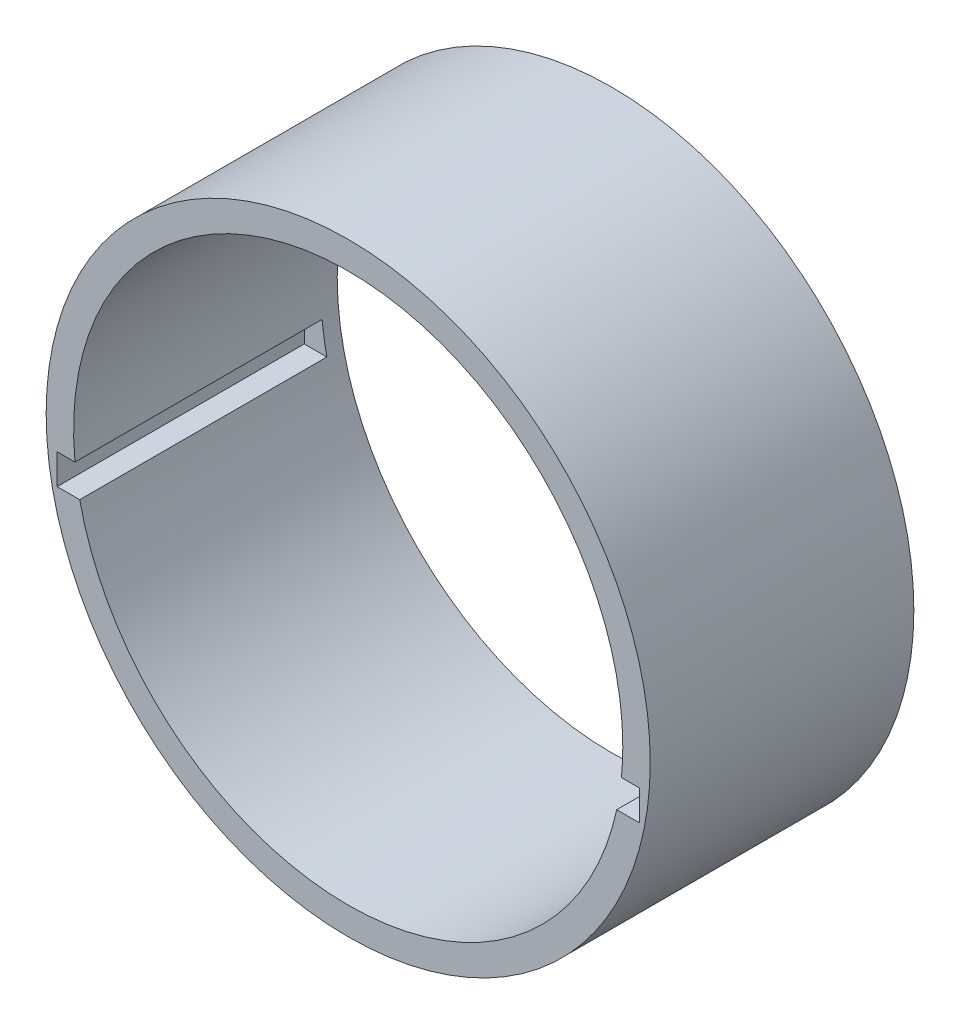
ISO-10303-21;
HEADER;
FILE_DESCRIPTION(('STEP AP214'),'2;1');
FILE_NAME('part.step','',(''),(''),'','','');
FILE_SCHEMA(('AUTOMOTIVE_DESIGN { 1 0 10303 214 1 1 1 1 }'));
ENDSEC;
DATA;
#1=APPLICATION_CONTEXT('core data for automotive mechanical design processes');
#2=APPLICATION_PROTOCOL_DEFINITION('international standard','automotive_design',2000,#1);
#3=PRODUCT_CONTEXT('',#1,'mechanical');
#4=PRODUCT('Part','Part','',(#3));
#5=PRODUCT_RELATED_PRODUCT_CATEGORY('part','',(#4));
#6=PRODUCT_DEFINITION_FORMATION('','',#4);
#7=PRODUCT_DEFINITION_CONTEXT('part definition',#1,'design');
#8=PRODUCT_DEFINITION('design','',#6,#7);
#9=PRODUCT_DEFINITION_SHAPE('','',#8);
#10=(LENGTH_UNIT() NAMED_UNIT(*) SI_UNIT(.MILLI.,.METRE.));
#11=(NAMED_UNIT(*) PLANE_ANGLE_UNIT() SI_UNIT($,.RADIAN.));
#12=(NAMED_UNIT(*) SI_UNIT($,.STERADIAN.) SOLID_ANGLE_UNIT());
#13=UNCERTAINTY_MEASURE_WITH_UNIT(LENGTH_MEASURE(1.E-05),#10,'distance_accuracy_value','');
#14=(GEOMETRIC_REPRESENTATION_CONTEXT(3) GLOBAL_UNCERTAINTY_ASSIGNED_CONTEXT((#13)) GLOBAL_UNIT_ASSIGNED_CONTEXT((#10,
#11,#12)) REPRESENTATION_CONTEXT('',''));
#15=CARTESIAN_POINT('',(0.,0.,0.));
#16=DIRECTION('',(0.,0.,1.));
#17=DIRECTION('',(1.,0.,0.));
#18=AXIS2_PLACEMENT_3D('',#15,#16,#17);
#19=CARTESIAN_POINT('',(0.,0.,48.));
#20=DIRECTION('',(0.,0.,-1.));
#21=DIRECTION('',(-1.,0.,0.));
#22=AXIS2_PLACEMENT_3D('',#19,#20,#21);
#23=CYLINDRICAL_SURFACE('',#22,55.);
#24=CARTESIAN_POINT('',(0.,0.,48.));
#25=DIRECTION('',(0.,0.,1.));
#26=DIRECTION('',(1.,0.,0.));
#27=AXIS2_PLACEMENT_3D('',#24,#25,#26);
#28=CIRCLE('',#27,55.);
#29=CARTESIAN_POINT('',(55.,0.,48.));
#30=VERTEX_POINT('',#29);
#31=EDGE_CURVE('E151',#30,#30,#28,.T.);
#32=ORIENTED_EDGE('',*,*,#31,.F.);
#33=EDGE_LOOP('',(#32));
#34=FACE_BOUND('',#33,.T.);
#35=CARTESIAN_POINT('',(0.,0.,0.));
#36=DIRECTION('',(0.,0.,1.));
#37=DIRECTION('',(1.,0.,0.));
#38=AXIS2_PLACEMENT_3D('',#35,#36,#37);
#39=CIRCLE('',#38,55.);
#40=CARTESIAN_POINT('',(55.,0.,0.));
#41=VERTEX_POINT('',#40);
#42=EDGE_CURVE('E147',#41,#41,#39,.T.);
#43=ORIENTED_EDGE('',*,*,#42,.T.);
#44=EDGE_LOOP('',(#43));
#45=FACE_BOUND('',#44,.T.);
#46=ADVANCED_FACE('F37',(#34,#45),#23,.T.);
#47=CARTESIAN_POINT('',(0.,0.,48.));
#48=DIRECTION('',(0.,0.,1.));
#49=DIRECTION('',(1.,0.,0.));
#50=AXIS2_PLACEMENT_3D('',#47,#48,#49);
#51=PLANE('',#50);
#52=DIRECTION('',(-1.,0.,0.));
#53=VECTOR('',#52,1.);
#54=CARTESIAN_POINT('',(-53.,-5.,48.));
#55=LINE('',#54,#53);
#56=CARTESIAN_POINT('',(-49.749371855331,-5.,48.));
#57=VERTEX_POINT('',#56);
#58=CARTESIAN_POINT('',(-53.,-5.,48.));
#59=VERTEX_POINT('',#58);
#60=EDGE_CURVE('E125',#57,#59,#55,.T.);
#61=ORIENTED_EDGE('',*,*,#60,.F.);
#62=CARTESIAN_POINT('',(0.,0.,48.));
#63=DIRECTION('',(0.,0.,1.));
#64=DIRECTION('',(1.,0.,0.));
#65=AXIS2_PLACEMENT_3D('',#62,#63,#64);
#66=CIRCLE('',#65,50.);
#67=CARTESIAN_POINT('',(49.749371855331,-5.,48.));
#68=VERTEX_POINT('',#67);
#69=EDGE_CURVE('E139',#68,#57,#66,.T.);
#70=ORIENTED_EDGE('',*,*,#69,.F.);
#71=CARTESIAN_POINT('',(53.,-5.,48.));
#72=VERTEX_POINT('',#71);
#73=EDGE_CURVE('E123',#72,#68,#55,.T.);
#74=ORIENTED_EDGE('',*,*,#73,.F.);
#75=DIRECTION('',(0.,1.,0.));
#76=VECTOR('',#75,1.);
#77=CARTESIAN_POINT('',(53.,-10.5,48.));
#78=LINE('',#77,#76);
#79=CARTESIAN_POINT('',(53.,-10.5,48.));
#80=VERTEX_POINT('',#79);
#81=EDGE_CURVE('E134',#80,#72,#78,.T.);
#82=ORIENTED_EDGE('',*,*,#81,.F.);
#83=DIRECTION('',(1.,0.,0.));
#84=VECTOR('',#83,1.);
#85=CARTESIAN_POINT('',(-53.,-10.5,48.));
#86=LINE('',#85,#84);
#87=CARTESIAN_POINT('',(48.8850692952357,-10.5,48.));
#88=VERTEX_POINT('',#87);
#89=EDGE_CURVE('E131',#88,#80,#86,.T.);
#90=ORIENTED_EDGE('',*,*,#89,.F.);
#91=CARTESIAN_POINT('',(-48.8850692952357,-10.5,48.));
#92=VERTEX_POINT('',#91);
#93=EDGE_CURVE('E148',#92,#88,#66,.T.);
#94=ORIENTED_EDGE('',*,*,#93,.F.);
#95=CARTESIAN_POINT('',(-53.,-10.5,48.));
#96=VERTEX_POINT('',#95);
#97=EDGE_CURVE('E132',#96,#92,#86,.T.);
#98=ORIENTED_EDGE('',*,*,#97,.F.);
#99=DIRECTION('',(0.,-1.,0.));
#100=VECTOR('',#99,1.);
#101=CARTESIAN_POINT('',(-53.,-10.5,48.));
#102=LINE('',#101,#100);
#103=EDGE_CURVE('E108',#59,#96,#102,.T.);
#104=ORIENTED_EDGE('',*,*,#103,.F.);
#105=EDGE_LOOP('',(#61,#70,#74,#82,#90,#94,#98,#104));
#106=FACE_BOUND('',#105,.T.);
#107=ORIENTED_EDGE('',*,*,#31,.T.);
#108=EDGE_LOOP('',(#107));
#109=FACE_BOUND('',#108,.T.);
#110=ADVANCED_FACE('F174',(#106,#109),#51,.T.);
#111=CARTESIAN_POINT('',(0.,0.,0.));
#112=DIRECTION('',(0.,0.,1.));
#113=DIRECTION('',(1.,0.,0.));
#114=AXIS2_PLACEMENT_3D('',#111,#112,#113);
#115=PLANE('',#114);
#116=CARTESIAN_POINT('',(0.,0.,0.));
#117=DIRECTION('',(0.,0.,1.));
#118=DIRECTION('',(1.,0.,0.));
#119=AXIS2_PLACEMENT_3D('',#116,#117,#118);
#120=CIRCLE('',#119,50.);
#121=CARTESIAN_POINT('',(50.,0.,0.));
#122=VERTEX_POINT('',#121);
#123=EDGE_CURVE('E144',#122,#122,#120,.T.);
#124=ORIENTED_EDGE('',*,*,#123,.T.);
#125=EDGE_LOOP('',(#124));
#126=FACE_BOUND('',#125,.T.);
#127=ORIENTED_EDGE('',*,*,#42,.F.);
#128=EDGE_LOOP('',(#127));
#129=FACE_BOUND('',#128,.T.);
#130=ADVANCED_FACE('F203',(#126,#129),#115,.F.);
#131=CARTESIAN_POINT('',(0.,0.,0.));
#132=DIRECTION('',(0.,0.,1.));
#133=DIRECTION('',(1.,0.,0.));
#134=AXIS2_PLACEMENT_3D('',#131,#132,#133);
#135=CYLINDRICAL_SURFACE('',#134,50.);
#136=ORIENTED_EDGE('',*,*,#69,.T.);
#137=DIRECTION('',(0.,0.,1.));
#138=VECTOR('',#137,1.);
#139=CARTESIAN_POINT('',(-49.749371855331,-5.,0.));
#140=LINE('',#139,#138);
#141=CARTESIAN_POINT('',(-49.749371855331,-5.,3.));
#142=VERTEX_POINT('',#141);
#143=EDGE_CURVE('E11',#57,#142,#140,.F.);
#144=ORIENTED_EDGE('',*,*,#143,.T.);
#145=CARTESIAN_POINT('',(0.,0.,3.));
#146=DIRECTION('',(0.,0.,-1.));
#147=DIRECTION('',(-1.,0.,0.));
#148=AXIS2_PLACEMENT_3D('',#145,#146,#147);
#149=CIRCLE('',#148,50.);
#150=CARTESIAN_POINT('',(-48.8850692952357,-10.5,3.));
#151=VERTEX_POINT('',#150);
#152=EDGE_CURVE('E160',#142,#151,#149,.F.);
#153=ORIENTED_EDGE('',*,*,#152,.T.);
#154=DIRECTION('',(0.,0.,1.));
#155=VECTOR('',#154,1.);
#156=CARTESIAN_POINT('',(-48.8850692952357,-10.5,0.));
#157=LINE('',#156,#155);
#158=EDGE_CURVE('E44',#151,#92,#157,.T.);
#159=ORIENTED_EDGE('',*,*,#158,.T.);
#160=ORIENTED_EDGE('',*,*,#93,.T.);
#161=DIRECTION('',(0.,0.,1.));
#162=VECTOR('',#161,1.);
#163=CARTESIAN_POINT('',(48.8850692952357,-10.5,0.));
#164=LINE('',#163,#162);
#165=CARTESIAN_POINT('',(48.8850692952357,-10.5,3.));
#166=VERTEX_POINT('',#165);
#167=EDGE_CURVE('E159',#88,#166,#164,.F.);
#168=ORIENTED_EDGE('',*,*,#167,.T.);
#169=CARTESIAN_POINT('',(49.749371855331,-5.,3.));
#170=VERTEX_POINT('',#169);
#171=EDGE_CURVE('E154',#166,#170,#149,.F.);
#172=ORIENTED_EDGE('',*,*,#171,.T.);
#173=DIRECTION('',(0.,0.,1.));
#174=VECTOR('',#173,1.);
#175=CARTESIAN_POINT('',(49.749371855331,-5.,0.));
#176=LINE('',#175,#174);
#177=EDGE_CURVE('E163',#170,#68,#176,.T.);
#178=ORIENTED_EDGE('',*,*,#177,.T.);
#179=EDGE_LOOP('',(#136,#144,#153,#159,#160,#168,#172,#178));
#180=FACE_BOUND('',#179,.T.);
#181=ORIENTED_EDGE('',*,*,#123,.F.);
#182=EDGE_LOOP('',(#181));
#183=FACE_BOUND('',#182,.T.);
#184=ADVANCED_FACE('F168',(#180,#183),#135,.F.);
#185=CARTESIAN_POINT('',(0.,0.,3.));
#186=DIRECTION('',(0.,0.,-1.));
#187=DIRECTION('',(-1.,0.,0.));
#188=AXIS2_PLACEMENT_3D('',#185,#186,#187);
#189=PLANE('',#188);
#190=DIRECTION('',(1.,0.,0.));
#191=VECTOR('',#190,1.);
#192=CARTESIAN_POINT('',(-53.,-10.5,3.));
#193=LINE('',#192,#191);
#194=CARTESIAN_POINT('',(53.,-10.5,3.));
#195=VERTEX_POINT('',#194);
#196=EDGE_CURVE('E117',#166,#195,#193,.T.);
#197=ORIENTED_EDGE('',*,*,#196,.T.);
#198=DIRECTION('',(0.,1.,0.));
#199=VECTOR('',#198,1.);
#200=CARTESIAN_POINT('',(53.,-10.5,3.));
#201=LINE('',#200,#199);
#202=CARTESIAN_POINT('',(53.,-5.,3.));
#203=VERTEX_POINT('',#202);
#204=EDGE_CURVE('E116',#195,#203,#201,.T.);
#205=ORIENTED_EDGE('',*,*,#204,.T.);
#206=DIRECTION('',(-1.,0.,0.));
#207=VECTOR('',#206,1.);
#208=CARTESIAN_POINT('',(-53.,-5.,3.));
#209=LINE('',#208,#207);
#210=EDGE_CURVE('E59',#203,#170,#209,.T.);
#211=ORIENTED_EDGE('',*,*,#210,.T.);
#212=ORIENTED_EDGE('',*,*,#171,.F.);
#213=EDGE_LOOP('',(#197,#205,#211,#212));
#214=FACE_BOUND('',#213,.T.);
#215=ADVANCED_FACE('F184',(#214),#189,.F.);
#216=CARTESIAN_POINT('',(-53.,-10.5,3.));
#217=DIRECTION('',(0.,-1.,0.));
#218=DIRECTION('',(0.,0.,-1.));
#219=AXIS2_PLACEMENT_3D('',#216,#217,#218);
#220=PLANE('',#219);
#221=ORIENTED_EDGE('',*,*,#89,.T.);
#222=DIRECTION('',(0.,0.,1.));
#223=VECTOR('',#222,1.);
#224=CARTESIAN_POINT('',(53.,-10.5,3.));
#225=LINE('',#224,#223);
#226=EDGE_CURVE('E111',#195,#80,#225,.T.);
#227=ORIENTED_EDGE('',*,*,#226,.F.);
#228=ORIENTED_EDGE('',*,*,#196,.F.);
#229=ORIENTED_EDGE('',*,*,#167,.F.);
#230=EDGE_LOOP('',(#221,#227,#228,#229));
#231=FACE_BOUND('',#230,.T.);
#232=ADVANCED_FACE('F181',(#231),#220,.F.);
#233=CARTESIAN_POINT('',(-53.,-5.,3.));
#234=DIRECTION('',(0.,1.,0.));
#235=DIRECTION('',(0.,0.,1.));
#236=AXIS2_PLACEMENT_3D('',#233,#234,#235);
#237=PLANE('',#236);
#238=ORIENTED_EDGE('',*,*,#210,.F.);
#239=DIRECTION('',(0.,0.,1.));
#240=VECTOR('',#239,1.);
#241=CARTESIAN_POINT('',(53.,-5.,3.));
#242=LINE('',#241,#240);
#243=EDGE_CURVE('E140',#203,#72,#242,.T.);
#244=ORIENTED_EDGE('',*,*,#243,.T.);
#245=ORIENTED_EDGE('',*,*,#73,.T.);
#246=ORIENTED_EDGE('',*,*,#177,.F.);
#247=EDGE_LOOP('',(#238,#244,#245,#246));
#248=FACE_BOUND('',#247,.T.);
#249=ADVANCED_FACE('F187',(#248),#237,.F.);
#250=CARTESIAN_POINT('',(53.,-10.5,3.));
#251=DIRECTION('',(1.,0.,0.));
#252=DIRECTION('',(0.,0.,-1.));
#253=AXIS2_PLACEMENT_3D('',#250,#251,#252);
#254=PLANE('',#253);
#255=ORIENTED_EDGE('',*,*,#81,.T.);
#256=ORIENTED_EDGE('',*,*,#243,.F.);
#257=ORIENTED_EDGE('',*,*,#204,.F.);
#258=ORIENTED_EDGE('',*,*,#226,.T.);
#259=EDGE_LOOP('',(#255,#256,#257,#258));
#260=FACE_BOUND('',#259,.T.);
#261=ADVANCED_FACE('F189',(#260),#254,.F.);
#262=ORIENTED_EDGE('',*,*,#60,.T.);
#263=DIRECTION('',(0.,0.,1.));
#264=VECTOR('',#263,1.);
#265=CARTESIAN_POINT('',(-53.,-5.,3.));
#266=LINE('',#265,#264);
#267=CARTESIAN_POINT('',(-53.,-5.,3.));
#268=VERTEX_POINT('',#267);
#269=EDGE_CURVE('E137',#268,#59,#266,.T.);
#270=ORIENTED_EDGE('',*,*,#269,.F.);
#271=EDGE_CURVE('E121',#142,#268,#209,.T.);
#272=ORIENTED_EDGE('',*,*,#271,.F.);
#273=ORIENTED_EDGE('',*,*,#143,.F.);
#274=EDGE_LOOP('',(#262,#270,#272,#273));
#275=FACE_BOUND('',#274,.T.);
#276=ADVANCED_FACE('F171',(#275),#237,.F.);
#277=CARTESIAN_POINT('',(-53.,-10.5,3.));
#278=VERTEX_POINT('',#277);
#279=EDGE_CURVE('E51',#278,#151,#193,.T.);
#280=ORIENTED_EDGE('',*,*,#279,.F.);
#281=DIRECTION('',(0.,0.,1.));
#282=VECTOR('',#281,1.);
#283=CARTESIAN_POINT('',(-53.,-10.5,3.));
#284=LINE('',#283,#282);
#285=EDGE_CURVE('E103',#278,#96,#284,.T.);
#286=ORIENTED_EDGE('',*,*,#285,.T.);
#287=ORIENTED_EDGE('',*,*,#97,.T.);
#288=ORIENTED_EDGE('',*,*,#158,.F.);
#289=EDGE_LOOP('',(#280,#286,#287,#288));
#290=FACE_BOUND('',#289,.T.);
#291=ADVANCED_FACE('F113',(#290),#220,.F.);
#292=ORIENTED_EDGE('',*,*,#271,.T.);
#293=DIRECTION('',(0.,-1.,0.));
#294=VECTOR('',#293,1.);
#295=CARTESIAN_POINT('',(-53.,-10.5,3.));
#296=LINE('',#295,#294);
#297=EDGE_CURVE('E106',#268,#278,#296,.T.);
#298=ORIENTED_EDGE('',*,*,#297,.T.);
#299=ORIENTED_EDGE('',*,*,#279,.T.);
#300=ORIENTED_EDGE('',*,*,#152,.F.);
#301=EDGE_LOOP('',(#292,#298,#299,#300));
#302=FACE_BOUND('',#301,.T.);
#303=ADVANCED_FACE('F119',(#302),#189,.F.);
#304=CARTESIAN_POINT('',(-53.,-10.5,3.));
#305=DIRECTION('',(-1.,0.,0.));
#306=DIRECTION('',(0.,0.,1.));
#307=AXIS2_PLACEMENT_3D('',#304,#305,#306);
#308=PLANE('',#307);
#309=ORIENTED_EDGE('',*,*,#103,.T.);
#310=ORIENTED_EDGE('',*,*,#285,.F.);
#311=ORIENTED_EDGE('',*,*,#297,.F.);
#312=ORIENTED_EDGE('',*,*,#269,.T.);
#313=EDGE_LOOP('',(#309,#310,#311,#312));
#314=FACE_BOUND('',#313,.T.);
#315=ADVANCED_FACE('F104',(#314),#308,.F.);
#316=CLOSED_SHELL('',(#46,#110,#130,#184,#215,#232,#249,#261,#276,#291,#303,#315));
#317=MANIFOLD_SOLID_BREP('B2',#316);
#318=ADVANCED_BREP_SHAPE_REPRESENTATION('',(#18,#317),#14);
#319=SHAPE_DEFINITION_REPRESENTATION(#9,#318);
ENDSEC;
END-ISO-10303-21;
